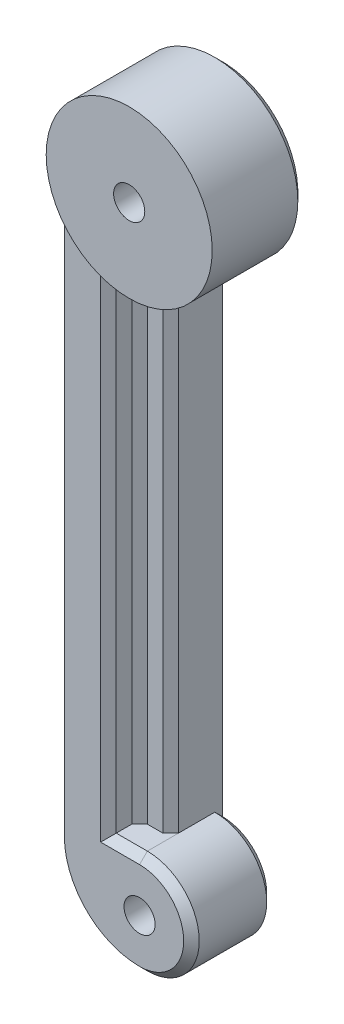
ISO-10303-21;
HEADER;
FILE_DESCRIPTION(('STEP AP214'),'2;1');
FILE_NAME('part.step','',(''),(''),'','','');
FILE_SCHEMA(('AUTOMOTIVE_DESIGN { 1 0 10303 214 1 1 1 1 }'));
ENDSEC;
DATA;
#1=APPLICATION_CONTEXT('core data for automotive mechanical design processes');
#2=APPLICATION_PROTOCOL_DEFINITION('international standard','automotive_design',2000,#1);
#3=PRODUCT_CONTEXT('',#1,'mechanical');
#4=PRODUCT('Part','Part','',(#3));
#5=PRODUCT_RELATED_PRODUCT_CATEGORY('part','',(#4));
#6=PRODUCT_DEFINITION_FORMATION('','',#4);
#7=PRODUCT_DEFINITION_CONTEXT('part definition',#1,'design');
#8=PRODUCT_DEFINITION('design','',#6,#7);
#9=PRODUCT_DEFINITION_SHAPE('','',#8);
#10=(LENGTH_UNIT() NAMED_UNIT(*) SI_UNIT(.MILLI.,.METRE.));
#11=(NAMED_UNIT(*) PLANE_ANGLE_UNIT() SI_UNIT($,.RADIAN.));
#12=(NAMED_UNIT(*) SI_UNIT($,.STERADIAN.) SOLID_ANGLE_UNIT());
#13=UNCERTAINTY_MEASURE_WITH_UNIT(LENGTH_MEASURE(1.E-05),#10,'distance_accuracy_value','');
#14=(GEOMETRIC_REPRESENTATION_CONTEXT(3) GLOBAL_UNCERTAINTY_ASSIGNED_CONTEXT((#13)) GLOBAL_UNIT_ASSIGNED_CONTEXT((#10,
#11,#12)) REPRESENTATION_CONTEXT('',''));
#15=CARTESIAN_POINT('',(0.,0.,0.));
#16=DIRECTION('',(0.,0.,1.));
#17=DIRECTION('',(1.,0.,0.));
#18=AXIS2_PLACEMENT_3D('',#15,#16,#17);
#19=CARTESIAN_POINT('',(0.,60.,5.));
#20=DIRECTION('',(0.,0.,-1.));
#21=DIRECTION('',(-1.,0.,0.));
#22=AXIS2_PLACEMENT_3D('',#19,#20,#21);
#23=CYLINDRICAL_SURFACE('',#22,1.5);
#24=CARTESIAN_POINT('',(0.,60.,9.));
#25=DIRECTION('',(0.,0.,1.));
#26=DIRECTION('',(1.,0.,0.));
#27=AXIS2_PLACEMENT_3D('',#24,#25,#26);
#28=CIRCLE('',#27,1.5);
#29=CARTESIAN_POINT('',(1.5,60.,9.));
#30=VERTEX_POINT('',#29);
#31=EDGE_CURVE('E401',#30,#30,#28,.T.);
#32=ORIENTED_EDGE('',*,*,#31,.T.);
#33=EDGE_LOOP('',(#32));
#34=FACE_BOUND('',#33,.T.);
#35=CARTESIAN_POINT('',(0.,60.,2.5));
#36=DIRECTION('',(0.,0.,-1.));
#37=DIRECTION('',(-1.,0.,0.));
#38=AXIS2_PLACEMENT_3D('',#35,#36,#37);
#39=CIRCLE('',#38,1.5);
#40=CARTESIAN_POINT('',(-1.5,60.,2.5));
#41=VERTEX_POINT('',#40);
#42=EDGE_CURVE('E395',#41,#41,#39,.T.);
#43=ORIENTED_EDGE('',*,*,#42,.T.);
#44=EDGE_LOOP('',(#43));
#45=FACE_BOUND('',#44,.T.);
#46=ADVANCED_FACE('F39',(#34,#45),#23,.F.);
#47=CARTESIAN_POINT('',(0.,0.,5.));
#48=DIRECTION('',(0.,0.,-1.));
#49=DIRECTION('',(-1.,0.,0.));
#50=AXIS2_PLACEMENT_3D('',#47,#48,#49);
#51=CYLINDRICAL_SURFACE('',#50,1.5);
#52=CARTESIAN_POINT('',(0.,0.,8.));
#53=DIRECTION('',(0.,0.,1.));
#54=DIRECTION('',(1.,0.,0.));
#55=AXIS2_PLACEMENT_3D('',#52,#53,#54);
#56=CIRCLE('',#55,1.5);
#57=CARTESIAN_POINT('',(1.5,0.,8.));
#58=VERTEX_POINT('',#57);
#59=EDGE_CURVE('E390',#58,#58,#56,.T.);
#60=ORIENTED_EDGE('',*,*,#59,.T.);
#61=EDGE_LOOP('',(#60));
#62=FACE_BOUND('',#61,.T.);
#63=CARTESIAN_POINT('',(0.,0.,2.5));
#64=DIRECTION('',(0.,0.,-1.));
#65=DIRECTION('',(-1.,0.,0.));
#66=AXIS2_PLACEMENT_3D('',#63,#64,#65);
#67=CIRCLE('',#66,1.5);
#68=CARTESIAN_POINT('',(-1.5,0.,2.5));
#69=VERTEX_POINT('',#68);
#70=EDGE_CURVE('E313',#69,#69,#67,.T.);
#71=ORIENTED_EDGE('',*,*,#70,.T.);
#72=EDGE_LOOP('',(#71));
#73=FACE_BOUND('',#72,.T.);
#74=ADVANCED_FACE('F642',(#62,#73),#51,.F.);
#75=CARTESIAN_POINT('',(0.,3.,5.));
#76=DIRECTION('',(0.,0.,1.));
#77=DIRECTION('',(1.,0.,0.));
#78=AXIS2_PLACEMENT_3D('',#75,#76,#77);
#79=PLANE('',#78);
#80=CARTESIAN_POINT('',(0.,60.,5.));
#81=DIRECTION('',(0.,0.,1.));
#82=DIRECTION('',(1.,0.,0.));
#83=AXIS2_PLACEMENT_3D('',#80,#81,#82);
#84=CIRCLE('',#83,8.);
#85=CARTESIAN_POINT('',(-2.25000000000001,52.322923733608,5.));
#86=VERTEX_POINT('',#85);
#87=CARTESIAN_POINT('',(-0.749999999999987,52.035233838963,5.));
#88=VERTEX_POINT('',#87);
#89=EDGE_CURVE('E405',#86,#88,#84,.T.);
#90=ORIENTED_EDGE('',*,*,#89,.F.);
#91=DIRECTION('',(0.,-1.,0.));
#92=VECTOR('',#91,1.);
#93=CARTESIAN_POINT('',(-2.25000000000001,3.,5.));
#94=LINE('',#93,#92);
#95=CARTESIAN_POINT('',(-2.25000000000001,5.,5.));
#96=VERTEX_POINT('',#95);
#97=EDGE_CURVE('E61',#86,#96,#94,.T.);
#98=ORIENTED_EDGE('',*,*,#97,.T.);
#99=DIRECTION('',(-1.,0.,0.));
#100=VECTOR('',#99,1.);
#101=CARTESIAN_POINT('',(-3.,5.,5.));
#102=LINE('',#101,#100);
#103=CARTESIAN_POINT('',(-0.749999999999987,5.,5.));
#104=VERTEX_POINT('',#103);
#105=EDGE_CURVE('E394',#104,#96,#102,.T.);
#106=ORIENTED_EDGE('',*,*,#105,.F.);
#107=DIRECTION('',(0.,1.,0.));
#108=VECTOR('',#107,1.);
#109=CARTESIAN_POINT('',(-0.749999999999987,52.,5.));
#110=LINE('',#109,#108);
#111=EDGE_CURVE('E535',#104,#88,#110,.T.);
#112=ORIENTED_EDGE('',*,*,#111,.T.);
#113=EDGE_LOOP('',(#90,#98,#106,#112));
#114=FACE_BOUND('',#113,.T.);
#115=ADVANCED_FACE('F565',(#114),#79,.T.);
#116=CARTESIAN_POINT('',(0.,60.,5.));
#117=DIRECTION('',(0.,0.,-1.));
#118=DIRECTION('',(-1.,0.,0.));
#119=AXIS2_PLACEMENT_3D('',#116,#117,#118);
#120=CYLINDRICAL_SURFACE('',#119,8.);
#121=CARTESIAN_POINT('',(0.,60.,9.));
#122=DIRECTION('',(0.,0.,1.));
#123=DIRECTION('',(1.,0.,0.));
#124=AXIS2_PLACEMENT_3D('',#121,#122,#123);
#125=CIRCLE('',#124,8.);
#126=CARTESIAN_POINT('',(8.,60.,9.));
#127=VERTEX_POINT('',#126);
#128=EDGE_CURVE('E406',#127,#127,#125,.T.);
#129=ORIENTED_EDGE('',*,*,#128,.F.);
#130=EDGE_LOOP('',(#129));
#131=FACE_BOUND('',#130,.T.);
#132=DIRECTION('',(0.,0.,-1.));
#133=VECTOR('',#132,1.);
#134=CARTESIAN_POINT('',(-3.,52.5838015129043,5.));
#135=LINE('',#134,#133);
#136=CARTESIAN_POINT('',(-3.,52.5838015129043,5.75));
#137=VERTEX_POINT('',#136);
#138=CARTESIAN_POINT('',(-3.,52.5838015129043,7.25));
#139=VERTEX_POINT('',#138);
#140=EDGE_CURVE('E431',#137,#139,#135,.F.);
#141=ORIENTED_EDGE('',*,*,#140,.F.);
#142=CARTESIAN_POINT('',(0.,60.,2.74999999999997));
#143=DIRECTION('',(-0.707106781186551,0.,-0.707106781186544));
#144=DIRECTION('',(0.707106781186544,0.,-0.707106781186551));
#145=AXIS2_PLACEMENT_3D('',#142,#143,#144);
#146=ELLIPSE('',#145,11.3137084989848,8.);
#147=EDGE_CURVE('E533',#137,#86,#146,.F.);
#148=ORIENTED_EDGE('',*,*,#147,.T.);
#149=ORIENTED_EDGE('',*,*,#89,.T.);
#150=CARTESIAN_POINT('',(0.,60.,4.25000000000001));
#151=DIRECTION('',(0.707106781186551,0.,0.707106781186544));
#152=DIRECTION('',(0.707106781186544,0.,-0.707106781186551));
#153=AXIS2_PLACEMENT_3D('',#150,#151,#152);
#154=ELLIPSE('',#153,11.3137084989848,8.);
#155=CARTESIAN_POINT('',(0.,52.,4.25000000000001));
#156=VERTEX_POINT('',#155);
#157=EDGE_CURVE('E47',#88,#156,#154,.T.);
#158=ORIENTED_EDGE('',*,*,#157,.T.);
#159=DIRECTION('',(0.,0.,-1.));
#160=VECTOR('',#159,1.);
#161=CARTESIAN_POINT('',(0.,52.,5.));
#162=LINE('',#161,#160);
#163=CARTESIAN_POINT('',(0.,52.,0.74999999999998));
#164=VERTEX_POINT('',#163);
#165=EDGE_CURVE('E421',#156,#164,#162,.T.);
#166=ORIENTED_EDGE('',*,*,#165,.T.);
#167=CARTESIAN_POINT('',(0.,60.,0.74999999999998));
#168=DIRECTION('',(0.,0.,1.));
#169=DIRECTION('',(1.,0.,0.));
#170=AXIS2_PLACEMENT_3D('',#167,#168,#169);
#171=CIRCLE('',#170,8.);
#172=CARTESIAN_POINT('',(-8.,60.,0.74999999999998));
#173=VERTEX_POINT('',#172);
#174=EDGE_CURVE('E465',#164,#173,#171,.T.);
#175=ORIENTED_EDGE('',*,*,#174,.T.);
#176=DIRECTION('',(0.,0.,-1.));
#177=VECTOR('',#176,1.);
#178=CARTESIAN_POINT('',(-8.,60.,5.));
#179=LINE('',#178,#177);
#180=CARTESIAN_POINT('',(-8.,60.,7.25000000000001));
#181=VERTEX_POINT('',#180);
#182=EDGE_CURVE('E418',#181,#173,#179,.T.);
#183=ORIENTED_EDGE('',*,*,#182,.F.);
#184=CARTESIAN_POINT('',(0.,60.,15.25));
#185=DIRECTION('',(0.707106781186549,0.,-0.707106781186546));
#186=DIRECTION('',(-0.707106781186546,0.,-0.707106781186549));
#187=AXIS2_PLACEMENT_3D('',#184,#185,#186);
#188=ELLIPSE('',#187,11.3137084989848,8.);
#189=CARTESIAN_POINT('',(-7.25000000000002,56.6180626853829,8.));
#190=VERTEX_POINT('',#189);
#191=EDGE_CURVE('E509',#181,#190,#188,.F.);
#192=ORIENTED_EDGE('',*,*,#191,.T.);
#193=CARTESIAN_POINT('',(0.,60.,8.));
#194=DIRECTION('',(0.,0.,-1.));
#195=DIRECTION('',(-1.,0.,0.));
#196=AXIS2_PLACEMENT_3D('',#193,#194,#195);
#197=CIRCLE('',#196,8.);
#198=CARTESIAN_POINT('',(-3.74999999999999,52.9333529874487,8.));
#199=VERTEX_POINT('',#198);
#200=EDGE_CURVE('E429',#199,#190,#197,.T.);
#201=ORIENTED_EDGE('',*,*,#200,.F.);
#202=CARTESIAN_POINT('',(0.,60.,4.24999999999997));
#203=DIRECTION('',(-0.707106781186551,0.,-0.707106781186544));
#204=DIRECTION('',(0.707106781186544,0.,-0.707106781186551));
#205=AXIS2_PLACEMENT_3D('',#202,#203,#204);
#206=ELLIPSE('',#205,11.3137084989848,8.);
#207=EDGE_CURVE('E546',#199,#139,#206,.F.);
#208=ORIENTED_EDGE('',*,*,#207,.T.);
#209=EDGE_LOOP('',(#141,#148,#149,#158,#166,#175,#183,#192,#201,#208));
#210=FACE_BOUND('',#209,.T.);
#211=ADVANCED_FACE('F553',(#131,#210),#120,.T.);
#212=CARTESIAN_POINT('',(0.,3.,0.));
#213=DIRECTION('',(0.,0.,1.));
#214=DIRECTION('',(1.,0.,0.));
#215=AXIS2_PLACEMENT_3D('',#212,#213,#214);
#216=PLANE('',#215);
#217=DIRECTION('',(0.5,0.866025403784438,0.));
#218=VECTOR('',#217,1.);
#219=CARTESIAN_POINT('',(-3.17542648054294,60.,0.));
#220=LINE('',#219,#218);
#221=CARTESIAN_POINT('',(-3.17542648054294,60.,0.));
#222=VERTEX_POINT('',#221);
#223=CARTESIAN_POINT('',(-1.58771324027147,62.75,0.));
#224=VERTEX_POINT('',#223);
#225=EDGE_CURVE('E296',#222,#224,#220,.T.);
#226=ORIENTED_EDGE('',*,*,#225,.F.);
#227=DIRECTION('',(-0.499999999999999,0.866025403784439,0.));
#228=VECTOR('',#227,1.);
#229=CARTESIAN_POINT('',(-1.58771324027147,57.25,0.));
#230=LINE('',#229,#228);
#231=CARTESIAN_POINT('',(-1.58771324027147,57.25,0.));
#232=VERTEX_POINT('',#231);
#233=EDGE_CURVE('E255',#232,#222,#230,.T.);
#234=ORIENTED_EDGE('',*,*,#233,.F.);
#235=DIRECTION('',(-1.,0.,0.));
#236=VECTOR('',#235,1.);
#237=CARTESIAN_POINT('',(1.58771324027147,57.25,0.));
#238=LINE('',#237,#236);
#239=CARTESIAN_POINT('',(1.58771324027147,57.25,0.));
#240=VERTEX_POINT('',#239);
#241=EDGE_CURVE('E276',#240,#232,#238,.T.);
#242=ORIENTED_EDGE('',*,*,#241,.F.);
#243=DIRECTION('',(-0.5,-0.866025403784439,0.));
#244=VECTOR('',#243,1.);
#245=CARTESIAN_POINT('',(3.17542648054294,60.,0.));
#246=LINE('',#245,#244);
#247=CARTESIAN_POINT('',(3.17542648054294,60.,0.));
#248=VERTEX_POINT('',#247);
#249=EDGE_CURVE('E280',#248,#240,#246,.T.);
#250=ORIENTED_EDGE('',*,*,#249,.F.);
#251=DIRECTION('',(0.5,-0.866025403784439,0.));
#252=VECTOR('',#251,1.);
#253=CARTESIAN_POINT('',(1.58771324027147,62.75,0.));
#254=LINE('',#253,#252);
#255=CARTESIAN_POINT('',(1.58771324027147,62.75,0.));
#256=VERTEX_POINT('',#255);
#257=EDGE_CURVE('E303',#256,#248,#254,.T.);
#258=ORIENTED_EDGE('',*,*,#257,.F.);
#259=DIRECTION('',(1.,0.,0.));
#260=VECTOR('',#259,1.);
#261=CARTESIAN_POINT('',(-1.58771324027147,62.75,0.));
#262=LINE('',#261,#260);
#263=EDGE_CURVE('E299',#224,#256,#262,.T.);
#264=ORIENTED_EDGE('',*,*,#263,.F.);
#265=EDGE_LOOP('',(#226,#234,#242,#250,#258,#264));
#266=FACE_BOUND('',#265,.T.);
#267=DIRECTION('',(0.5,0.866025403784438,0.));
#268=VECTOR('',#267,1.);
#269=CARTESIAN_POINT('',(-3.17542648054294,0.,0.));
#270=LINE('',#269,#268);
#271=CARTESIAN_POINT('',(-3.17542648054294,0.,0.));
#272=VERTEX_POINT('',#271);
#273=CARTESIAN_POINT('',(-1.58771324027147,2.75,0.));
#274=VERTEX_POINT('',#273);
#275=EDGE_CURVE('E353',#272,#274,#270,.T.);
#276=ORIENTED_EDGE('',*,*,#275,.F.);
#277=DIRECTION('',(-0.499999999999999,0.866025403784439,0.));
#278=VECTOR('',#277,1.);
#279=CARTESIAN_POINT('',(-1.58771324027147,-2.75,0.));
#280=LINE('',#279,#278);
#281=CARTESIAN_POINT('',(-1.58771324027147,-2.75,0.));
#282=VERTEX_POINT('',#281);
#283=EDGE_CURVE('E350',#282,#272,#280,.T.);
#284=ORIENTED_EDGE('',*,*,#283,.F.);
#285=DIRECTION('',(-1.,0.,0.));
#286=VECTOR('',#285,1.);
#287=CARTESIAN_POINT('',(1.58771324027147,-2.75,0.));
#288=LINE('',#287,#286);
#289=CARTESIAN_POINT('',(1.58771324027147,-2.75,0.));
#290=VERTEX_POINT('',#289);
#291=EDGE_CURVE('E330',#290,#282,#288,.T.);
#292=ORIENTED_EDGE('',*,*,#291,.F.);
#293=DIRECTION('',(-0.5,-0.866025403784439,0.));
#294=VECTOR('',#293,1.);
#295=CARTESIAN_POINT('',(3.17542648054294,0.,0.));
#296=LINE('',#295,#294);
#297=CARTESIAN_POINT('',(3.17542648054294,0.,0.));
#298=VERTEX_POINT('',#297);
#299=EDGE_CURVE('E366',#298,#290,#296,.T.);
#300=ORIENTED_EDGE('',*,*,#299,.F.);
#301=DIRECTION('',(0.5,-0.866025403784439,0.));
#302=VECTOR('',#301,1.);
#303=CARTESIAN_POINT('',(1.58771324027147,2.75,0.));
#304=LINE('',#303,#302);
#305=CARTESIAN_POINT('',(1.58771324027147,2.75,0.));
#306=VERTEX_POINT('',#305);
#307=EDGE_CURVE('E362',#306,#298,#304,.T.);
#308=ORIENTED_EDGE('',*,*,#307,.F.);
#309=DIRECTION('',(1.,0.,0.));
#310=VECTOR('',#309,1.);
#311=CARTESIAN_POINT('',(-1.58771324027147,2.75,0.));
#312=LINE('',#311,#310);
#313=EDGE_CURVE('E358',#274,#306,#312,.T.);
#314=ORIENTED_EDGE('',*,*,#313,.F.);
#315=EDGE_LOOP('',(#276,#284,#292,#300,#308,#314));
#316=FACE_BOUND('',#315,.T.);
#317=DIRECTION('',(0.,1.,0.));
#318=VECTOR('',#317,1.);
#319=CARTESIAN_POINT('',(0.,5.,0.));
#320=LINE('',#319,#318);
#321=CARTESIAN_POINT('',(0.,4.25000000000002,0.));
#322=VERTEX_POINT('',#321);
#323=CARTESIAN_POINT('',(0.,52.75,0.));
#324=VERTEX_POINT('',#323);
#325=EDGE_CURVE('E410',#322,#324,#320,.T.);
#326=ORIENTED_EDGE('',*,*,#325,.F.);
#327=CARTESIAN_POINT('',(0.,0.,0.));
#328=DIRECTION('',(0.,0.,1.));
#329=DIRECTION('',(1.,0.,0.));
#330=AXIS2_PLACEMENT_3D('',#327,#328,#329);
#331=CIRCLE('',#330,4.25000000000002);
#332=CARTESIAN_POINT('',(0.,-4.25000000000002,0.));
#333=VERTEX_POINT('',#332);
#334=EDGE_CURVE('E454',#322,#333,#331,.F.);
#335=ORIENTED_EDGE('',*,*,#334,.T.);
#336=CARTESIAN_POINT('',(0.,3.,0.));
#337=DIRECTION('',(0.,0.,1.));
#338=DIRECTION('',(1.,0.,0.));
#339=AXIS2_PLACEMENT_3D('',#336,#337,#338);
#340=CIRCLE('',#339,7.25000000000002);
#341=CARTESIAN_POINT('',(-7.25000000000002,3.,0.));
#342=VERTEX_POINT('',#341);
#343=EDGE_CURVE('E451',#333,#342,#340,.F.);
#344=ORIENTED_EDGE('',*,*,#343,.T.);
#345=DIRECTION('',(0.,1.,0.));
#346=VECTOR('',#345,1.);
#347=CARTESIAN_POINT('',(-7.25000000000002,3.,0.));
#348=LINE('',#347,#346);
#349=CARTESIAN_POINT('',(-7.25000000000001,60.,0.));
#350=VERTEX_POINT('',#349);
#351=EDGE_CURVE('E448',#342,#350,#348,.T.);
#352=ORIENTED_EDGE('',*,*,#351,.T.);
#353=CARTESIAN_POINT('',(0.,60.,0.));
#354=DIRECTION('',(0.,0.,1.));
#355=DIRECTION('',(1.,0.,0.));
#356=AXIS2_PLACEMENT_3D('',#353,#354,#355);
#357=CIRCLE('',#356,7.25000000000001);
#358=EDGE_CURVE('E444',#350,#324,#357,.F.);
#359=ORIENTED_EDGE('',*,*,#358,.T.);
#360=EDGE_LOOP('',(#326,#335,#344,#352,#359));
#361=FACE_BOUND('',#360,.T.);
#362=ADVANCED_FACE('F627',(#266,#316,#361),#216,.F.);
#363=CARTESIAN_POINT('',(0.,3.,5.));
#364=DIRECTION('',(0.,0.,-1.));
#365=DIRECTION('',(-1.,0.,0.));
#366=AXIS2_PLACEMENT_3D('',#363,#364,#365);
#367=CYLINDRICAL_SURFACE('',#366,8.);
#368=DIRECTION('',(0.,0.,-1.));
#369=VECTOR('',#368,1.);
#370=CARTESIAN_POINT('',(0.,-5.,5.));
#371=LINE('',#370,#369);
#372=CARTESIAN_POINT('',(0.,-5.,7.25000000000001));
#373=VERTEX_POINT('',#372);
#374=CARTESIAN_POINT('',(0.,-5.,0.74999999999998));
#375=VERTEX_POINT('',#374);
#376=EDGE_CURVE('E426',#373,#375,#371,.T.);
#377=ORIENTED_EDGE('',*,*,#376,.F.);
#378=CARTESIAN_POINT('',(0.,3.,7.25000000000001));
#379=DIRECTION('',(0.,0.,-1.));
#380=DIRECTION('',(-1.,0.,0.));
#381=AXIS2_PLACEMENT_3D('',#378,#379,#380);
#382=CIRCLE('',#381,8.);
#383=CARTESIAN_POINT('',(-8.,3.,7.25000000000001));
#384=VERTEX_POINT('',#383);
#385=EDGE_CURVE('E506',#373,#384,#382,.T.);
#386=ORIENTED_EDGE('',*,*,#385,.T.);
#387=DIRECTION('',(0.,0.,-1.));
#388=VECTOR('',#387,1.);
#389=CARTESIAN_POINT('',(-8.,3.,5.));
#390=LINE('',#389,#388);
#391=CARTESIAN_POINT('',(-8.,3.,0.74999999999998));
#392=VERTEX_POINT('',#391);
#393=EDGE_CURVE('E415',#384,#392,#390,.T.);
#394=ORIENTED_EDGE('',*,*,#393,.T.);
#395=CARTESIAN_POINT('',(0.,3.,0.74999999999998));
#396=DIRECTION('',(0.,0.,1.));
#397=DIRECTION('',(1.,0.,0.));
#398=AXIS2_PLACEMENT_3D('',#395,#396,#397);
#399=CIRCLE('',#398,8.);
#400=EDGE_CURVE('E457',#392,#375,#399,.T.);
#401=ORIENTED_EDGE('',*,*,#400,.T.);
#402=EDGE_LOOP('',(#377,#386,#394,#401));
#403=FACE_BOUND('',#402,.T.);
#404=ADVANCED_FACE('F597',(#403),#367,.T.);
#405=CARTESIAN_POINT('',(0.,0.,5.));
#406=DIRECTION('',(0.,0.,-1.));
#407=DIRECTION('',(-1.,0.,0.));
#408=AXIS2_PLACEMENT_3D('',#405,#406,#407);
#409=CYLINDRICAL_SURFACE('',#408,5.);
#410=DIRECTION('',(0.,0.,-1.));
#411=VECTOR('',#410,1.);
#412=CARTESIAN_POINT('',(0.,5.,8.));
#413=LINE('',#412,#411);
#414=CARTESIAN_POINT('',(0.,5.,7.25000000000001));
#415=VERTEX_POINT('',#414);
#416=CARTESIAN_POINT('',(0.,5.,4.25000000000001));
#417=VERTEX_POINT('',#416);
#418=EDGE_CURVE('E53',#415,#417,#413,.T.);
#419=ORIENTED_EDGE('',*,*,#418,.F.);
#420=CARTESIAN_POINT('',(0.,0.,7.25000000000001));
#421=DIRECTION('',(0.,0.,-1.));
#422=DIRECTION('',(-1.,0.,0.));
#423=AXIS2_PLACEMENT_3D('',#420,#421,#422);
#424=CIRCLE('',#423,5.);
#425=EDGE_CURVE('E503',#415,#373,#424,.T.);
#426=ORIENTED_EDGE('',*,*,#425,.T.);
#427=ORIENTED_EDGE('',*,*,#376,.T.);
#428=CARTESIAN_POINT('',(0.,0.,0.74999999999998));
#429=DIRECTION('',(0.,0.,1.));
#430=DIRECTION('',(1.,0.,0.));
#431=AXIS2_PLACEMENT_3D('',#428,#429,#430);
#432=CIRCLE('',#431,5.);
#433=CARTESIAN_POINT('',(0.,5.,0.74999999999998));
#434=VERTEX_POINT('',#433);
#435=EDGE_CURVE('E434',#375,#434,#432,.T.);
#436=ORIENTED_EDGE('',*,*,#435,.T.);
#437=DIRECTION('',(0.,0.,-1.));
#438=VECTOR('',#437,1.);
#439=CARTESIAN_POINT('',(0.,5.,5.));
#440=LINE('',#439,#438);
#441=EDGE_CURVE('E423',#417,#434,#440,.T.);
#442=ORIENTED_EDGE('',*,*,#441,.F.);
#443=EDGE_LOOP('',(#419,#426,#427,#436,#442));
#444=FACE_BOUND('',#443,.T.);
#445=ADVANCED_FACE('F584',(#444),#409,.T.);
#446=CARTESIAN_POINT('',(0.,5.,5.));
#447=DIRECTION('',(-1.,0.,0.));
#448=DIRECTION('',(0.,0.,1.));
#449=AXIS2_PLACEMENT_3D('',#446,#447,#448);
#450=PLANE('',#449);
#451=ORIENTED_EDGE('',*,*,#165,.F.);
#452=DIRECTION('',(0.,-1.,0.));
#453=VECTOR('',#452,1.);
#454=CARTESIAN_POINT('',(0.,5.,4.25000000000001));
#455=LINE('',#454,#453);
#456=EDGE_CURVE('E543',#156,#417,#455,.T.);
#457=ORIENTED_EDGE('',*,*,#456,.T.);
#458=ORIENTED_EDGE('',*,*,#441,.T.);
#459=DIRECTION('',(0.,-0.70710678118655,-0.707106781186545));
#460=VECTOR('',#459,1.);
#461=CARTESIAN_POINT('',(0.,0.,-4.24999999999999));
#462=LINE('',#461,#460);
#463=EDGE_CURVE('E469',#434,#322,#462,.T.);
#464=ORIENTED_EDGE('',*,*,#463,.T.);
#465=ORIENTED_EDGE('',*,*,#325,.T.);
#466=DIRECTION('',(0.,-0.70710678118655,0.707106781186545));
#467=VECTOR('',#466,1.);
#468=CARTESIAN_POINT('',(0.,60.,-7.24999999999997));
#469=LINE('',#468,#467);
#470=EDGE_CURVE('E473',#324,#164,#469,.T.);
#471=ORIENTED_EDGE('',*,*,#470,.T.);
#472=EDGE_LOOP('',(#451,#457,#458,#464,#465,#471));
#473=FACE_BOUND('',#472,.T.);
#474=ADVANCED_FACE('F558',(#473),#450,.F.);
#475=CARTESIAN_POINT('',(-8.,3.,5.));
#476=DIRECTION('',(1.,0.,0.));
#477=DIRECTION('',(0.,0.,-1.));
#478=AXIS2_PLACEMENT_3D('',#475,#476,#477);
#479=PLANE('',#478);
#480=ORIENTED_EDGE('',*,*,#393,.F.);
#481=DIRECTION('',(0.,1.,0.));
#482=VECTOR('',#481,1.);
#483=CARTESIAN_POINT('',(-8.,3.,7.25000000000001));
#484=LINE('',#483,#482);
#485=EDGE_CURVE('E500',#384,#181,#484,.T.);
#486=ORIENTED_EDGE('',*,*,#485,.T.);
#487=ORIENTED_EDGE('',*,*,#182,.T.);
#488=DIRECTION('',(0.,-1.,0.));
#489=VECTOR('',#488,1.);
#490=CARTESIAN_POINT('',(-8.,3.,0.74999999999998));
#491=LINE('',#490,#489);
#492=EDGE_CURVE('E461',#173,#392,#491,.T.);
#493=ORIENTED_EDGE('',*,*,#492,.T.);
#494=EDGE_LOOP('',(#480,#486,#487,#493));
#495=FACE_BOUND('',#494,.T.);
#496=ADVANCED_FACE('F600',(#495),#479,.F.);
#497=CARTESIAN_POINT('',(0.,60.,9.));
#498=DIRECTION('',(0.,0.,1.));
#499=DIRECTION('',(1.,0.,0.));
#500=AXIS2_PLACEMENT_3D('',#497,#498,#499);
#501=PLANE('',#500);
#502=ORIENTED_EDGE('',*,*,#128,.T.);
#503=EDGE_LOOP('',(#502));
#504=FACE_BOUND('',#503,.T.);
#505=ORIENTED_EDGE('',*,*,#31,.F.);
#506=EDGE_LOOP('',(#505));
#507=FACE_BOUND('',#506,.T.);
#508=ADVANCED_FACE('F703',(#504,#507),#501,.T.);
#509=CARTESIAN_POINT('',(-3.,55.3715715678371,8.));
#510=DIRECTION('',(-1.,0.,0.));
#511=DIRECTION('',(0.,0.,1.));
#512=AXIS2_PLACEMENT_3D('',#509,#510,#511);
#513=PLANE('',#512);
#514=ORIENTED_EDGE('',*,*,#140,.T.);
#515=DIRECTION('',(0.,-1.,0.));
#516=VECTOR('',#515,1.);
#517=CARTESIAN_POINT('',(-3.,55.3715715678371,7.25));
#518=LINE('',#517,#516);
#519=CARTESIAN_POINT('',(-3.,5.,7.25000000000001));
#520=VERTEX_POINT('',#519);
#521=EDGE_CURVE('E530',#139,#520,#518,.T.);
#522=ORIENTED_EDGE('',*,*,#521,.T.);
#523=DIRECTION('',(0.,0.,-1.));
#524=VECTOR('',#523,1.);
#525=CARTESIAN_POINT('',(-3.,5.,8.));
#526=LINE('',#525,#524);
#527=CARTESIAN_POINT('',(-3.,5.,5.75));
#528=VERTEX_POINT('',#527);
#529=EDGE_CURVE('E397',#520,#528,#526,.T.);
#530=ORIENTED_EDGE('',*,*,#529,.T.);
#531=DIRECTION('',(0.,1.,0.));
#532=VECTOR('',#531,1.);
#533=CARTESIAN_POINT('',(-3.,55.3715715678371,5.75));
#534=LINE('',#533,#532);
#535=EDGE_CURVE('E526',#528,#137,#534,.T.);
#536=ORIENTED_EDGE('',*,*,#535,.T.);
#537=EDGE_LOOP('',(#514,#522,#530,#536));
#538=FACE_BOUND('',#537,.T.);
#539=ADVANCED_FACE('F572',(#538),#513,.F.);
#540=CARTESIAN_POINT('',(0.,0.,8.));
#541=DIRECTION('',(0.,0.,-1.));
#542=DIRECTION('',(-1.,0.,0.));
#543=AXIS2_PLACEMENT_3D('',#540,#541,#542);
#544=PLANE('',#543);
#545=DIRECTION('',(-1.,0.,0.));
#546=VECTOR('',#545,1.);
#547=CARTESIAN_POINT('',(0.,4.25000000000001,8.));
#548=LINE('',#547,#546);
#549=CARTESIAN_POINT('',(0.,4.25000000000001,8.));
#550=VERTEX_POINT('',#549);
#551=CARTESIAN_POINT('',(-3.74999999999999,4.25000000000001,8.));
#552=VERTEX_POINT('',#551);
#553=EDGE_CURVE('E496',#550,#552,#548,.T.);
#554=ORIENTED_EDGE('',*,*,#553,.T.);
#555=DIRECTION('',(0.,1.,0.));
#556=VECTOR('',#555,1.);
#557=CARTESIAN_POINT('',(-3.74999999999999,0.,8.));
#558=LINE('',#557,#556);
#559=EDGE_CURVE('E513',#552,#199,#558,.T.);
#560=ORIENTED_EDGE('',*,*,#559,.T.);
#561=ORIENTED_EDGE('',*,*,#200,.T.);
#562=DIRECTION('',(0.,-1.,0.));
#563=VECTOR('',#562,1.);
#564=CARTESIAN_POINT('',(-7.25000000000001,0.,8.));
#565=LINE('',#564,#563);
#566=CARTESIAN_POINT('',(-7.25000000000001,3.,8.));
#567=VERTEX_POINT('',#566);
#568=EDGE_CURVE('E493',#190,#567,#565,.T.);
#569=ORIENTED_EDGE('',*,*,#568,.T.);
#570=CARTESIAN_POINT('',(0.,3.,8.));
#571=DIRECTION('',(0.,0.,-1.));
#572=DIRECTION('',(-1.,0.,0.));
#573=AXIS2_PLACEMENT_3D('',#570,#571,#572);
#574=CIRCLE('',#573,7.25000000000001);
#575=CARTESIAN_POINT('',(0.,-4.25000000000001,8.));
#576=VERTEX_POINT('',#575);
#577=EDGE_CURVE('E476',#567,#576,#574,.F.);
#578=ORIENTED_EDGE('',*,*,#577,.T.);
#579=CARTESIAN_POINT('',(0.,0.,8.));
#580=DIRECTION('',(0.,0.,-1.));
#581=DIRECTION('',(-1.,0.,0.));
#582=AXIS2_PLACEMENT_3D('',#579,#580,#581);
#583=CIRCLE('',#582,4.25000000000001);
#584=EDGE_CURVE('E490',#576,#550,#583,.F.);
#585=ORIENTED_EDGE('',*,*,#584,.T.);
#586=EDGE_LOOP('',(#554,#560,#561,#569,#578,#585));
#587=FACE_BOUND('',#586,.T.);
#588=ORIENTED_EDGE('',*,*,#59,.F.);
#589=EDGE_LOOP('',(#588));
#590=FACE_BOUND('',#589,.T.);
#591=ADVANCED_FACE('F680',(#587,#590),#544,.F.);
#592=CARTESIAN_POINT('',(-3.,5.,8.));
#593=DIRECTION('',(0.,-1.,0.));
#594=DIRECTION('',(0.,0.,-1.));
#595=AXIS2_PLACEMENT_3D('',#592,#593,#594);
#596=PLANE('',#595);
#597=ORIENTED_EDGE('',*,*,#105,.T.);
#598=DIRECTION('',(-0.707106781186544,0.,0.707106781186551));
#599=VECTOR('',#598,1.);
#600=CARTESIAN_POINT('',(-3.,5.,5.75));
#601=LINE('',#600,#599);
#602=EDGE_CURVE('E541',#96,#528,#601,.T.);
#603=ORIENTED_EDGE('',*,*,#602,.T.);
#604=ORIENTED_EDGE('',*,*,#529,.F.);
#605=DIRECTION('',(1.,0.,0.));
#606=VECTOR('',#605,1.);
#607=CARTESIAN_POINT('',(-3.,5.,7.25000000000001));
#608=LINE('',#607,#606);
#609=EDGE_CURVE('E498',#520,#415,#608,.T.);
#610=ORIENTED_EDGE('',*,*,#609,.T.);
#611=ORIENTED_EDGE('',*,*,#418,.T.);
#612=DIRECTION('',(-0.707106781186544,0.,0.707106781186551));
#613=VECTOR('',#612,1.);
#614=CARTESIAN_POINT('',(-3.37499999999998,5.,7.62500000000002));
#615=LINE('',#614,#613);
#616=EDGE_CURVE('E11',#417,#104,#615,.T.);
#617=ORIENTED_EDGE('',*,*,#616,.T.);
#618=EDGE_LOOP('',(#597,#603,#604,#610,#611,#617));
#619=FACE_BOUND('',#618,.T.);
#620=ADVANCED_FACE('F563',(#619),#596,.F.);
#621=CARTESIAN_POINT('',(-1.58771324027147,-2.75,2.5));
#622=DIRECTION('',(-0.866025403784439,-0.5,0.));
#623=DIRECTION('',(0.5,-0.866025403784439,0.));
#624=AXIS2_PLACEMENT_3D('',#621,#622,#623);
#625=PLANE('',#624);
#626=ORIENTED_EDGE('',*,*,#283,.T.);
#627=DIRECTION('',(0.,0.,-1.));
#628=VECTOR('',#627,1.);
#629=CARTESIAN_POINT('',(-3.17542648054294,0.,2.5));
#630=LINE('',#629,#628);
#631=CARTESIAN_POINT('',(-3.17542648054294,0.,2.5));
#632=VERTEX_POINT('',#631);
#633=EDGE_CURVE('E349',#632,#272,#630,.T.);
#634=ORIENTED_EDGE('',*,*,#633,.F.);
#635=DIRECTION('',(-0.499999999999999,0.866025403784439,0.));
#636=VECTOR('',#635,1.);
#637=CARTESIAN_POINT('',(-1.58771324027147,-2.75,2.5));
#638=LINE('',#637,#636);
#639=CARTESIAN_POINT('',(-1.58771324027147,-2.75,2.5));
#640=VERTEX_POINT('',#639);
#641=EDGE_CURVE('E325',#640,#632,#638,.T.);
#642=ORIENTED_EDGE('',*,*,#641,.F.);
#643=DIRECTION('',(0.,0.,-1.));
#644=VECTOR('',#643,1.);
#645=CARTESIAN_POINT('',(-1.58771324027147,-2.75,2.5));
#646=LINE('',#645,#644);
#647=EDGE_CURVE('E297',#640,#282,#646,.T.);
#648=ORIENTED_EDGE('',*,*,#647,.T.);
#649=EDGE_LOOP('',(#626,#634,#642,#648));
#650=FACE_BOUND('',#649,.T.);
#651=ADVANCED_FACE('F731',(#650),#625,.F.);
#652=CARTESIAN_POINT('',(1.58771324027147,-2.75,2.5));
#653=DIRECTION('',(0.,-1.,0.));
#654=DIRECTION('',(1.,0.,0.));
#655=AXIS2_PLACEMENT_3D('',#652,#653,#654);
#656=PLANE('',#655);
#657=ORIENTED_EDGE('',*,*,#291,.T.);
#658=ORIENTED_EDGE('',*,*,#647,.F.);
#659=DIRECTION('',(-1.,0.,0.));
#660=VECTOR('',#659,1.);
#661=CARTESIAN_POINT('',(1.58771324027147,-2.75,2.5));
#662=LINE('',#661,#660);
#663=CARTESIAN_POINT('',(1.58771324027147,-2.75,2.5));
#664=VERTEX_POINT('',#663);
#665=EDGE_CURVE('E345',#664,#640,#662,.T.);
#666=ORIENTED_EDGE('',*,*,#665,.F.);
#667=DIRECTION('',(0.,0.,-1.));
#668=VECTOR('',#667,1.);
#669=CARTESIAN_POINT('',(1.58771324027147,-2.75,2.5));
#670=LINE('',#669,#668);
#671=EDGE_CURVE('E375',#664,#290,#670,.T.);
#672=ORIENTED_EDGE('',*,*,#671,.T.);
#673=EDGE_LOOP('',(#657,#658,#666,#672));
#674=FACE_BOUND('',#673,.T.);
#675=ADVANCED_FACE('F754',(#674),#656,.F.);
#676=CARTESIAN_POINT('',(3.17542648054294,0.,2.5));
#677=DIRECTION('',(0.866025403784439,-0.5,0.));
#678=DIRECTION('',(0.5,0.866025403784439,0.));
#679=AXIS2_PLACEMENT_3D('',#676,#677,#678);
#680=PLANE('',#679);
#681=ORIENTED_EDGE('',*,*,#299,.T.);
#682=ORIENTED_EDGE('',*,*,#671,.F.);
#683=DIRECTION('',(-0.5,-0.866025403784439,0.));
#684=VECTOR('',#683,1.);
#685=CARTESIAN_POINT('',(3.17542648054294,0.,2.5));
#686=LINE('',#685,#684);
#687=CARTESIAN_POINT('',(3.17542648054294,0.,2.5));
#688=VERTEX_POINT('',#687);
#689=EDGE_CURVE('E341',#688,#664,#686,.T.);
#690=ORIENTED_EDGE('',*,*,#689,.F.);
#691=DIRECTION('',(0.,0.,-1.));
#692=VECTOR('',#691,1.);
#693=CARTESIAN_POINT('',(3.17542648054294,0.,2.5));
#694=LINE('',#693,#692);
#695=EDGE_CURVE('E378',#688,#298,#694,.T.);
#696=ORIENTED_EDGE('',*,*,#695,.T.);
#697=EDGE_LOOP('',(#681,#682,#690,#696));
#698=FACE_BOUND('',#697,.T.);
#699=ADVANCED_FACE('F763',(#698),#680,.F.);
#700=CARTESIAN_POINT('',(1.58771324027147,2.75,2.5));
#701=DIRECTION('',(0.866025403784439,0.5,0.));
#702=DIRECTION('',(-0.5,0.866025403784439,0.));
#703=AXIS2_PLACEMENT_3D('',#700,#701,#702);
#704=PLANE('',#703);
#705=ORIENTED_EDGE('',*,*,#307,.T.);
#706=ORIENTED_EDGE('',*,*,#695,.F.);
#707=DIRECTION('',(0.5,-0.866025403784439,0.));
#708=VECTOR('',#707,1.);
#709=CARTESIAN_POINT('',(1.58771324027147,2.75,2.5));
#710=LINE('',#709,#708);
#711=CARTESIAN_POINT('',(1.58771324027147,2.75,2.5));
#712=VERTEX_POINT('',#711);
#713=EDGE_CURVE('E337',#712,#688,#710,.T.);
#714=ORIENTED_EDGE('',*,*,#713,.F.);
#715=DIRECTION('',(0.,0.,-1.));
#716=VECTOR('',#715,1.);
#717=CARTESIAN_POINT('',(1.58771324027147,2.75,2.5));
#718=LINE('',#717,#716);
#719=EDGE_CURVE('E381',#712,#306,#718,.T.);
#720=ORIENTED_EDGE('',*,*,#719,.T.);
#721=EDGE_LOOP('',(#705,#706,#714,#720));
#722=FACE_BOUND('',#721,.T.);
#723=ADVANCED_FACE('F772',(#722),#704,.F.);
#724=CARTESIAN_POINT('',(-1.58771324027147,2.75,2.5));
#725=DIRECTION('',(0.,1.,0.));
#726=DIRECTION('',(0.,0.,1.));
#727=AXIS2_PLACEMENT_3D('',#724,#725,#726);
#728=PLANE('',#727);
#729=ORIENTED_EDGE('',*,*,#313,.T.);
#730=ORIENTED_EDGE('',*,*,#719,.F.);
#731=DIRECTION('',(1.,0.,0.));
#732=VECTOR('',#731,1.);
#733=CARTESIAN_POINT('',(-1.58771324027147,2.75,2.5));
#734=LINE('',#733,#732);
#735=CARTESIAN_POINT('',(-1.58771324027147,2.75,2.5));
#736=VERTEX_POINT('',#735);
#737=EDGE_CURVE('E334',#736,#712,#734,.T.);
#738=ORIENTED_EDGE('',*,*,#737,.F.);
#739=DIRECTION('',(0.,0.,-1.));
#740=VECTOR('',#739,1.);
#741=CARTESIAN_POINT('',(-1.58771324027147,2.75,2.5));
#742=LINE('',#741,#740);
#743=EDGE_CURVE('E384',#736,#274,#742,.T.);
#744=ORIENTED_EDGE('',*,*,#743,.T.);
#745=EDGE_LOOP('',(#729,#730,#738,#744));
#746=FACE_BOUND('',#745,.T.);
#747=ADVANCED_FACE('F781',(#746),#728,.F.);
#748=CARTESIAN_POINT('',(-3.17542648054294,0.,2.5));
#749=DIRECTION('',(-0.866025403784438,0.5,0.));
#750=DIRECTION('',(-0.5,-0.866025403784439,0.));
#751=AXIS2_PLACEMENT_3D('',#748,#749,#750);
#752=PLANE('',#751);
#753=ORIENTED_EDGE('',*,*,#275,.T.);
#754=ORIENTED_EDGE('',*,*,#743,.F.);
#755=DIRECTION('',(0.5,0.866025403784438,0.));
#756=VECTOR('',#755,1.);
#757=CARTESIAN_POINT('',(-3.17542648054294,0.,2.5));
#758=LINE('',#757,#756);
#759=EDGE_CURVE('E329',#632,#736,#758,.T.);
#760=ORIENTED_EDGE('',*,*,#759,.F.);
#761=ORIENTED_EDGE('',*,*,#633,.T.);
#762=EDGE_LOOP('',(#753,#754,#760,#761));
#763=FACE_BOUND('',#762,.T.);
#764=ADVANCED_FACE('F790',(#763),#752,.F.);
#765=CARTESIAN_POINT('',(0.,0.,2.5));
#766=DIRECTION('',(0.,0.,-1.));
#767=DIRECTION('',(-1.,0.,0.));
#768=AXIS2_PLACEMENT_3D('',#765,#766,#767);
#769=PLANE('',#768);
#770=ORIENTED_EDGE('',*,*,#70,.F.);
#771=EDGE_LOOP('',(#770));
#772=FACE_BOUND('',#771,.T.);
#773=ORIENTED_EDGE('',*,*,#641,.T.);
#774=ORIENTED_EDGE('',*,*,#759,.T.);
#775=ORIENTED_EDGE('',*,*,#737,.T.);
#776=ORIENTED_EDGE('',*,*,#713,.T.);
#777=ORIENTED_EDGE('',*,*,#689,.T.);
#778=ORIENTED_EDGE('',*,*,#665,.T.);
#779=EDGE_LOOP('',(#773,#774,#775,#776,#777,#778));
#780=FACE_BOUND('',#779,.T.);
#781=ADVANCED_FACE('F799',(#772,#780),#769,.T.);
#782=CARTESIAN_POINT('',(-1.58771324027147,57.25,2.5));
#783=DIRECTION('',(-0.866025403784439,-0.499999999999999,0.));
#784=DIRECTION('',(0.499999999999999,-0.866025403784439,0.));
#785=AXIS2_PLACEMENT_3D('',#782,#783,#784);
#786=PLANE('',#785);
#787=ORIENTED_EDGE('',*,*,#233,.T.);
#788=DIRECTION('',(0.,0.,-1.));
#789=VECTOR('',#788,1.);
#790=CARTESIAN_POINT('',(-3.17542648054294,60.,2.5));
#791=LINE('',#790,#789);
#792=CARTESIAN_POINT('',(-3.17542648054294,60.,2.5));
#793=VERTEX_POINT('',#792);
#794=EDGE_CURVE('E248',#793,#222,#791,.T.);
#795=ORIENTED_EDGE('',*,*,#794,.F.);
#796=DIRECTION('',(-0.499999999999999,0.866025403784439,0.));
#797=VECTOR('',#796,1.);
#798=CARTESIAN_POINT('',(-1.58771324027147,57.25,2.5));
#799=LINE('',#798,#797);
#800=CARTESIAN_POINT('',(-1.58771324027147,57.25,2.5));
#801=VERTEX_POINT('',#800);
#802=EDGE_CURVE('E252',#801,#793,#799,.T.);
#803=ORIENTED_EDGE('',*,*,#802,.F.);
#804=DIRECTION('',(0.,0.,-1.));
#805=VECTOR('',#804,1.);
#806=CARTESIAN_POINT('',(-1.58771324027147,57.25,2.5));
#807=LINE('',#806,#805);
#808=EDGE_CURVE('E310',#801,#232,#807,.T.);
#809=ORIENTED_EDGE('',*,*,#808,.T.);
#810=EDGE_LOOP('',(#787,#795,#803,#809));
#811=FACE_BOUND('',#810,.T.);
#812=ADVANCED_FACE('F250',(#811),#786,.F.);
#813=CARTESIAN_POINT('',(1.58771324027147,57.25,2.5));
#814=DIRECTION('',(0.,-1.,0.));
#815=DIRECTION('',(0.,0.,-1.));
#816=AXIS2_PLACEMENT_3D('',#813,#814,#815);
#817=PLANE('',#816);
#818=ORIENTED_EDGE('',*,*,#241,.T.);
#819=ORIENTED_EDGE('',*,*,#808,.F.);
#820=DIRECTION('',(-1.,0.,0.));
#821=VECTOR('',#820,1.);
#822=CARTESIAN_POINT('',(1.58771324027147,57.25,2.5));
#823=LINE('',#822,#821);
#824=CARTESIAN_POINT('',(1.58771324027147,57.25,2.5));
#825=VERTEX_POINT('',#824);
#826=EDGE_CURVE('E261',#825,#801,#823,.T.);
#827=ORIENTED_EDGE('',*,*,#826,.F.);
#828=DIRECTION('',(0.,0.,-1.));
#829=VECTOR('',#828,1.);
#830=CARTESIAN_POINT('',(1.58771324027147,57.25,2.5));
#831=LINE('',#830,#829);
#832=EDGE_CURVE('E314',#825,#240,#831,.T.);
#833=ORIENTED_EDGE('',*,*,#832,.T.);
#834=EDGE_LOOP('',(#818,#819,#827,#833));
#835=FACE_BOUND('',#834,.T.);
#836=ADVANCED_FACE('F816',(#835),#817,.F.);
#837=CARTESIAN_POINT('',(3.17542648054294,60.,2.5));
#838=DIRECTION('',(0.866025403784439,-0.5,0.));
#839=DIRECTION('',(0.5,0.866025403784439,0.));
#840=AXIS2_PLACEMENT_3D('',#837,#838,#839);
#841=PLANE('',#840);
#842=ORIENTED_EDGE('',*,*,#249,.T.);
#843=ORIENTED_EDGE('',*,*,#832,.F.);
#844=DIRECTION('',(-0.5,-0.866025403784439,0.));
#845=VECTOR('',#844,1.);
#846=CARTESIAN_POINT('',(3.17542648054294,60.,2.5));
#847=LINE('',#846,#845);
#848=CARTESIAN_POINT('',(3.17542648054294,60.,2.5));
#849=VERTEX_POINT('',#848);
#850=EDGE_CURVE('E289',#849,#825,#847,.T.);
#851=ORIENTED_EDGE('',*,*,#850,.F.);
#852=DIRECTION('',(0.,0.,-1.));
#853=VECTOR('',#852,1.);
#854=CARTESIAN_POINT('',(3.17542648054294,60.,2.5));
#855=LINE('',#854,#853);
#856=EDGE_CURVE('E317',#849,#248,#855,.T.);
#857=ORIENTED_EDGE('',*,*,#856,.T.);
#858=EDGE_LOOP('',(#842,#843,#851,#857));
#859=FACE_BOUND('',#858,.T.);
#860=ADVANCED_FACE('F824',(#859),#841,.F.);
#861=CARTESIAN_POINT('',(1.58771324027147,62.75,2.5));
#862=DIRECTION('',(0.866025403784439,0.5,0.));
#863=DIRECTION('',(-0.5,0.866025403784439,0.));
#864=AXIS2_PLACEMENT_3D('',#861,#862,#863);
#865=PLANE('',#864);
#866=ORIENTED_EDGE('',*,*,#257,.T.);
#867=ORIENTED_EDGE('',*,*,#856,.F.);
#868=DIRECTION('',(0.5,-0.866025403784439,0.));
#869=VECTOR('',#868,1.);
#870=CARTESIAN_POINT('',(1.58771324027147,62.75,2.5));
#871=LINE('',#870,#869);
#872=CARTESIAN_POINT('',(1.58771324027147,62.75,2.5));
#873=VERTEX_POINT('',#872);
#874=EDGE_CURVE('E285',#873,#849,#871,.T.);
#875=ORIENTED_EDGE('',*,*,#874,.F.);
#876=DIRECTION('',(0.,0.,-1.));
#877=VECTOR('',#876,1.);
#878=CARTESIAN_POINT('',(1.58771324027147,62.75,2.5));
#879=LINE('',#878,#877);
#880=EDGE_CURVE('E320',#873,#256,#879,.T.);
#881=ORIENTED_EDGE('',*,*,#880,.T.);
#882=EDGE_LOOP('',(#866,#867,#875,#881));
#883=FACE_BOUND('',#882,.T.);
#884=ADVANCED_FACE('F833',(#883),#865,.F.);
#885=CARTESIAN_POINT('',(-1.58771324027147,62.75,2.5));
#886=DIRECTION('',(0.,1.,0.));
#887=DIRECTION('',(0.,0.,1.));
#888=AXIS2_PLACEMENT_3D('',#885,#886,#887);
#889=PLANE('',#888);
#890=ORIENTED_EDGE('',*,*,#263,.T.);
#891=ORIENTED_EDGE('',*,*,#880,.F.);
#892=DIRECTION('',(1.,0.,0.));
#893=VECTOR('',#892,1.);
#894=CARTESIAN_POINT('',(-1.58771324027147,62.75,2.5));
#895=LINE('',#894,#893);
#896=CARTESIAN_POINT('',(-1.58771324027147,62.75,2.5));
#897=VERTEX_POINT('',#896);
#898=EDGE_CURVE('E270',#897,#873,#895,.T.);
#899=ORIENTED_EDGE('',*,*,#898,.F.);
#900=DIRECTION('',(0.,0.,-1.));
#901=VECTOR('',#900,1.);
#902=CARTESIAN_POINT('',(-1.58771324027147,62.75,2.5));
#903=LINE('',#902,#901);
#904=EDGE_CURVE('E260',#897,#224,#903,.T.);
#905=ORIENTED_EDGE('',*,*,#904,.T.);
#906=EDGE_LOOP('',(#890,#891,#899,#905));
#907=FACE_BOUND('',#906,.T.);
#908=ADVANCED_FACE('F842',(#907),#889,.F.);
#909=CARTESIAN_POINT('',(-3.17542648054294,60.,2.5));
#910=DIRECTION('',(-0.866025403784438,0.5,0.));
#911=DIRECTION('',(-0.5,-0.866025403784438,0.));
#912=AXIS2_PLACEMENT_3D('',#909,#910,#911);
#913=PLANE('',#912);
#914=ORIENTED_EDGE('',*,*,#225,.T.);
#915=ORIENTED_EDGE('',*,*,#904,.F.);
#916=DIRECTION('',(0.5,0.866025403784438,0.));
#917=VECTOR('',#916,1.);
#918=CARTESIAN_POINT('',(-3.17542648054294,60.,2.5));
#919=LINE('',#918,#917);
#920=EDGE_CURVE('E264',#793,#897,#919,.T.);
#921=ORIENTED_EDGE('',*,*,#920,.F.);
#922=ORIENTED_EDGE('',*,*,#794,.T.);
#923=EDGE_LOOP('',(#914,#915,#921,#922));
#924=FACE_BOUND('',#923,.T.);
#925=ADVANCED_FACE('F265',(#924),#913,.F.);
#926=CARTESIAN_POINT('',(0.,0.,2.5));
#927=DIRECTION('',(0.,0.,-1.));
#928=DIRECTION('',(-1.,0.,0.));
#929=AXIS2_PLACEMENT_3D('',#926,#927,#928);
#930=PLANE('',#929);
#931=ORIENTED_EDGE('',*,*,#42,.F.);
#932=EDGE_LOOP('',(#931));
#933=FACE_BOUND('',#932,.T.);
#934=ORIENTED_EDGE('',*,*,#802,.T.);
#935=ORIENTED_EDGE('',*,*,#920,.T.);
#936=ORIENTED_EDGE('',*,*,#898,.T.);
#937=ORIENTED_EDGE('',*,*,#874,.T.);
#938=ORIENTED_EDGE('',*,*,#850,.T.);
#939=ORIENTED_EDGE('',*,*,#826,.T.);
#940=EDGE_LOOP('',(#934,#935,#936,#937,#938,#939));
#941=FACE_BOUND('',#940,.T.);
#942=ADVANCED_FACE('F272',(#933,#941),#930,.T.);
#943=CARTESIAN_POINT('',(0.,60.,0.74999999999998));
#944=DIRECTION('',(0.,0.,1.));
#945=DIRECTION('',(1.,0.,0.));
#946=AXIS2_PLACEMENT_3D('',#943,#944,#945);
#947=CONICAL_SURFACE('',#946,8.,0.785398163397451);
#948=ORIENTED_EDGE('',*,*,#470,.F.);
#949=ORIENTED_EDGE('',*,*,#358,.F.);
#950=DIRECTION('',(0.707106781186551,0.,-0.707106781186544));
#951=VECTOR('',#950,1.);
#952=CARTESIAN_POINT('',(-8.,60.,0.74999999999998));
#953=LINE('',#952,#951);
#954=EDGE_CURVE('E354',#173,#350,#953,.T.);
#955=ORIENTED_EDGE('',*,*,#954,.F.);
#956=ORIENTED_EDGE('',*,*,#174,.F.);
#957=EDGE_LOOP('',(#948,#949,#955,#956));
#958=FACE_BOUND('',#957,.T.);
#959=ADVANCED_FACE('F612',(#958),#947,.T.);
#960=CARTESIAN_POINT('',(-8.,3.,0.74999999999998));
#961=DIRECTION('',(0.707106781186546,0.,0.70710678118655));
#962=DIRECTION('',(0.,-1.,0.));
#963=AXIS2_PLACEMENT_3D('',#960,#961,#962);
#964=PLANE('',#963);
#965=ORIENTED_EDGE('',*,*,#954,.T.);
#966=ORIENTED_EDGE('',*,*,#351,.F.);
#967=DIRECTION('',(0.70710678118655,0.,-0.707106781186546));
#968=VECTOR('',#967,1.);
#969=CARTESIAN_POINT('',(-8.,3.,0.74999999999998));
#970=LINE('',#969,#968);
#971=EDGE_CURVE('E481',#392,#342,#970,.T.);
#972=ORIENTED_EDGE('',*,*,#971,.F.);
#973=ORIENTED_EDGE('',*,*,#492,.F.);
#974=EDGE_LOOP('',(#965,#966,#972,#973));
#975=FACE_BOUND('',#974,.T.);
#976=ADVANCED_FACE('F615',(#975),#964,.F.);
#977=CARTESIAN_POINT('',(0.,3.,0.74999999999998));
#978=DIRECTION('',(0.,0.,1.));
#979=DIRECTION('',(1.,0.,0.));
#980=AXIS2_PLACEMENT_3D('',#977,#978,#979);
#981=CONICAL_SURFACE('',#980,8.,0.785398163397451);
#982=ORIENTED_EDGE('',*,*,#971,.T.);
#983=ORIENTED_EDGE('',*,*,#343,.F.);
#984=DIRECTION('',(0.,0.70710678118655,-0.707106781186546));
#985=VECTOR('',#984,1.);
#986=CARTESIAN_POINT('',(0.,-5.,0.74999999999998));
#987=LINE('',#986,#985);
#988=EDGE_CURVE('E477',#375,#333,#987,.T.);
#989=ORIENTED_EDGE('',*,*,#988,.F.);
#990=ORIENTED_EDGE('',*,*,#400,.F.);
#991=EDGE_LOOP('',(#982,#983,#989,#990));
#992=FACE_BOUND('',#991,.T.);
#993=ADVANCED_FACE('F620',(#992),#981,.T.);
#994=CARTESIAN_POINT('',(0.,0.,0.74999999999998));
#995=DIRECTION('',(0.,0.,1.));
#996=DIRECTION('',(1.,0.,0.));
#997=AXIS2_PLACEMENT_3D('',#994,#995,#996);
#998=CONICAL_SURFACE('',#997,5.,0.785398163397451);
#999=ORIENTED_EDGE('',*,*,#988,.T.);
#1000=ORIENTED_EDGE('',*,*,#334,.F.);
#1001=ORIENTED_EDGE('',*,*,#463,.F.);
#1002=ORIENTED_EDGE('',*,*,#435,.F.);
#1003=EDGE_LOOP('',(#999,#1000,#1001,#1002));
#1004=FACE_BOUND('',#1003,.T.);
#1005=ADVANCED_FACE('F625',(#1004),#998,.T.);
#1006=CARTESIAN_POINT('',(-7.25000000000001,0.,8.));
#1007=DIRECTION('',(0.707106781186549,0.,-0.707106781186546));
#1008=DIRECTION('',(0.,-1.,0.));
#1009=AXIS2_PLACEMENT_3D('',#1006,#1007,#1008);
#1010=PLANE('',#1009);
#1011=ORIENTED_EDGE('',*,*,#191,.F.);
#1012=ORIENTED_EDGE('',*,*,#485,.F.);
#1013=DIRECTION('',(-0.707106781186546,0.,-0.707106781186549));
#1014=VECTOR('',#1013,1.);
#1015=CARTESIAN_POINT('',(-7.25000000000001,3.,8.));
#1016=LINE('',#1015,#1014);
#1017=EDGE_CURVE('E482',#567,#384,#1016,.T.);
#1018=ORIENTED_EDGE('',*,*,#1017,.F.);
#1019=ORIENTED_EDGE('',*,*,#568,.F.);
#1020=EDGE_LOOP('',(#1011,#1012,#1018,#1019));
#1021=FACE_BOUND('',#1020,.T.);
#1022=ADVANCED_FACE('F606',(#1021),#1010,.F.);
#1023=CARTESIAN_POINT('',(0.,3.,8.));
#1024=DIRECTION('',(0.,0.,-1.));
#1025=DIRECTION('',(-1.,0.,0.));
#1026=AXIS2_PLACEMENT_3D('',#1023,#1024,#1025);
#1027=CONICAL_SURFACE('',#1026,7.25000000000001,0.785398163397446);
#1028=ORIENTED_EDGE('',*,*,#1017,.T.);
#1029=ORIENTED_EDGE('',*,*,#385,.F.);
#1030=DIRECTION('',(0.,-0.707106781186546,-0.707106781186549));
#1031=VECTOR('',#1030,1.);
#1032=CARTESIAN_POINT('',(0.,-4.25000000000001,8.));
#1033=LINE('',#1032,#1031);
#1034=EDGE_CURVE('E517',#576,#373,#1033,.T.);
#1035=ORIENTED_EDGE('',*,*,#1034,.F.);
#1036=ORIENTED_EDGE('',*,*,#577,.F.);
#1037=EDGE_LOOP('',(#1028,#1029,#1035,#1036));
#1038=FACE_BOUND('',#1037,.T.);
#1039=ADVANCED_FACE('F593',(#1038),#1027,.T.);
#1040=CARTESIAN_POINT('',(0.,0.,8.));
#1041=DIRECTION('',(0.,0.,-1.));
#1042=DIRECTION('',(-1.,0.,0.));
#1043=AXIS2_PLACEMENT_3D('',#1040,#1041,#1042);
#1044=CONICAL_SURFACE('',#1043,4.25000000000001,0.785398163397446);
#1045=ORIENTED_EDGE('',*,*,#1034,.T.);
#1046=ORIENTED_EDGE('',*,*,#425,.F.);
#1047=DIRECTION('',(0.,0.707106781186546,-0.707106781186549));
#1048=VECTOR('',#1047,1.);
#1049=CARTESIAN_POINT('',(0.,4.25000000000001,8.));
#1050=LINE('',#1049,#1048);
#1051=EDGE_CURVE('E514',#550,#415,#1050,.T.);
#1052=ORIENTED_EDGE('',*,*,#1051,.F.);
#1053=ORIENTED_EDGE('',*,*,#584,.F.);
#1054=EDGE_LOOP('',(#1045,#1046,#1052,#1053));
#1055=FACE_BOUND('',#1054,.T.);
#1056=ADVANCED_FACE('F587',(#1055),#1044,.T.);
#1057=CARTESIAN_POINT('',(0.,4.25000000000001,8.));
#1058=DIRECTION('',(0.,-0.707106781186549,-0.707106781186546));
#1059=DIRECTION('',(-1.,0.,0.));
#1060=AXIS2_PLACEMENT_3D('',#1057,#1058,#1059);
#1061=PLANE('',#1060);
#1062=ORIENTED_EDGE('',*,*,#1051,.T.);
#1063=ORIENTED_EDGE('',*,*,#609,.F.);
#1064=DIRECTION('',(-0.577350269189623,-0.577350269189626,0.577350269189628));
#1065=VECTOR('',#1064,1.);
#1066=CARTESIAN_POINT('',(-5.16666666666666,2.83333333333334,9.41666666666668));
#1067=LINE('',#1066,#1065);
#1068=EDGE_CURVE('E548',#520,#552,#1067,.T.);
#1069=ORIENTED_EDGE('',*,*,#1068,.T.);
#1070=ORIENTED_EDGE('',*,*,#553,.F.);
#1071=EDGE_LOOP('',(#1062,#1063,#1069,#1070));
#1072=FACE_BOUND('',#1071,.T.);
#1073=ADVANCED_FACE('F580',(#1072),#1061,.F.);
#1074=CARTESIAN_POINT('',(-3.74999999999999,0.,8.));
#1075=DIRECTION('',(-0.707106781186551,0.,-0.707106781186544));
#1076=DIRECTION('',(0.,1.,0.));
#1077=AXIS2_PLACEMENT_3D('',#1074,#1075,#1076);
#1078=PLANE('',#1077);
#1079=ORIENTED_EDGE('',*,*,#1068,.F.);
#1080=ORIENTED_EDGE('',*,*,#521,.F.);
#1081=ORIENTED_EDGE('',*,*,#207,.F.);
#1082=ORIENTED_EDGE('',*,*,#559,.F.);
#1083=EDGE_LOOP('',(#1079,#1080,#1081,#1082));
#1084=FACE_BOUND('',#1083,.T.);
#1085=ADVANCED_FACE('F576',(#1084),#1078,.F.);
#1086=CARTESIAN_POINT('',(-3.,55.3715715678371,5.75));
#1087=DIRECTION('',(-0.707106781186551,0.,-0.707106781186544));
#1088=DIRECTION('',(0.,1.,0.));
#1089=AXIS2_PLACEMENT_3D('',#1086,#1087,#1088);
#1090=PLANE('',#1089);
#1091=ORIENTED_EDGE('',*,*,#602,.F.);
#1092=ORIENTED_EDGE('',*,*,#97,.F.);
#1093=ORIENTED_EDGE('',*,*,#147,.F.);
#1094=ORIENTED_EDGE('',*,*,#535,.F.);
#1095=EDGE_LOOP('',(#1091,#1092,#1093,#1094));
#1096=FACE_BOUND('',#1095,.T.);
#1097=ADVANCED_FACE('F567',(#1096),#1090,.F.);
#1098=CARTESIAN_POINT('',(-0.749999999999987,3.,5.));
#1099=DIRECTION('',(0.707106781186551,0.,0.707106781186544));
#1100=DIRECTION('',(0.,-1.,0.));
#1101=AXIS2_PLACEMENT_3D('',#1098,#1099,#1100);
#1102=PLANE('',#1101);
#1103=ORIENTED_EDGE('',*,*,#616,.F.);
#1104=ORIENTED_EDGE('',*,*,#456,.F.);
#1105=ORIENTED_EDGE('',*,*,#157,.F.);
#1106=ORIENTED_EDGE('',*,*,#111,.F.);
#1107=EDGE_LOOP('',(#1103,#1104,#1105,#1106));
#1108=FACE_BOUND('',#1107,.T.);
#1109=ADVANCED_FACE('F41',(#1108),#1102,.T.);
#1110=CLOSED_SHELL('',(#46,#74,#115,#211,#362,#404,#445,#474,#496,#508,#539,#591,#620,#651,#675,
#699,#723,#747,#764,#781,#812,#836,#860,#884,#908,#925,#942,#959,#976,#993,#1005,#1022,#1039,
#1056,#1073,#1085,#1097,#1109));
#1111=MANIFOLD_SOLID_BREP('B2',#1110);
#1112=ADVANCED_BREP_SHAPE_REPRESENTATION('',(#18,#1111),#14);
#1113=SHAPE_DEFINITION_REPRESENTATION(#9,#1112);
ENDSEC;
END-ISO-10303-21;
